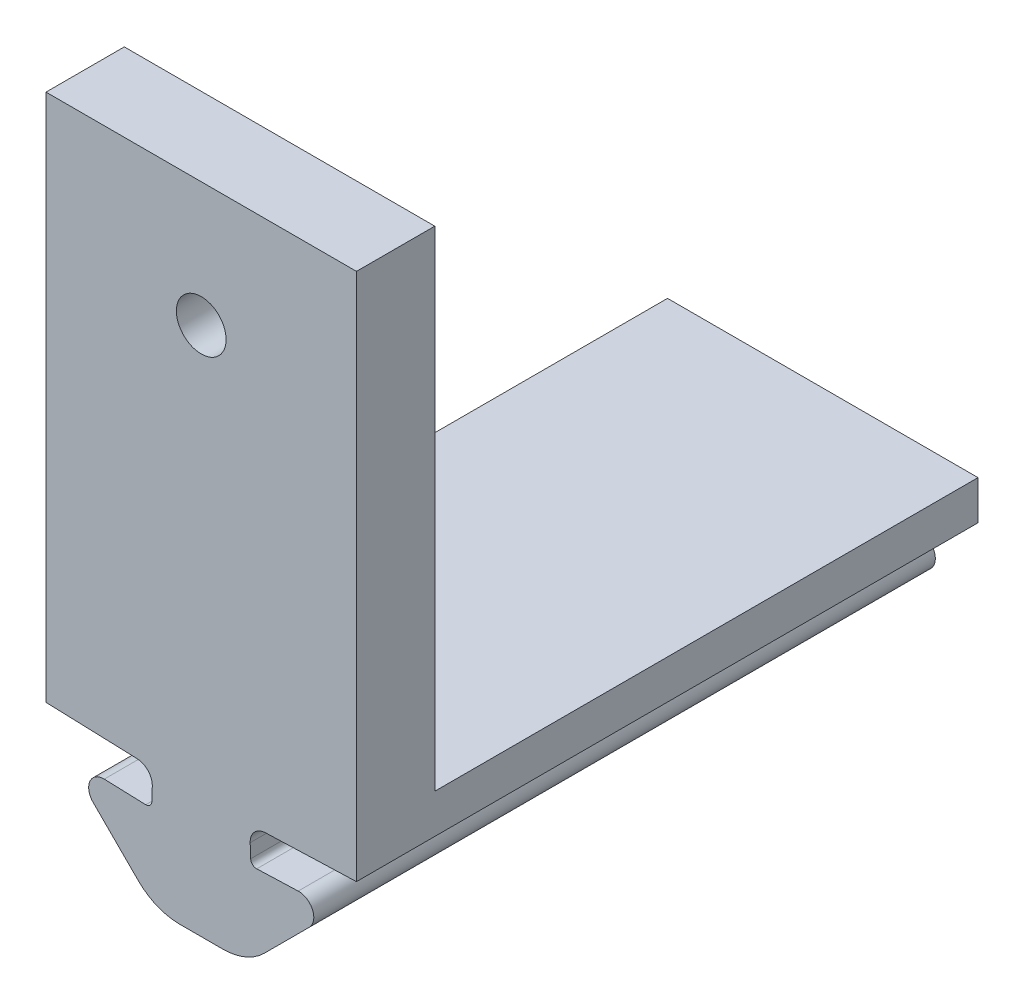
ISO-10303-21;
HEADER;
FILE_DESCRIPTION(('STEP AP214'),'2;1');
FILE_NAME('part.step','',(''),(''),'','','');
FILE_SCHEMA(('AUTOMOTIVE_DESIGN { 1 0 10303 214 1 1 1 1 }'));
ENDSEC;
DATA;
#1=APPLICATION_CONTEXT('core data for automotive mechanical design processes');
#2=APPLICATION_PROTOCOL_DEFINITION('international standard','automotive_design',2000,#1);
#3=PRODUCT_CONTEXT('',#1,'mechanical');
#4=PRODUCT('Part','Part','',(#3));
#5=PRODUCT_RELATED_PRODUCT_CATEGORY('part','',(#4));
#6=PRODUCT_DEFINITION_FORMATION('','',#4);
#7=PRODUCT_DEFINITION_CONTEXT('part definition',#1,'design');
#8=PRODUCT_DEFINITION('design','',#6,#7);
#9=PRODUCT_DEFINITION_SHAPE('','',#8);
#10=(LENGTH_UNIT() NAMED_UNIT(*) SI_UNIT(.MILLI.,.METRE.));
#11=(NAMED_UNIT(*) PLANE_ANGLE_UNIT() SI_UNIT($,.RADIAN.));
#12=(NAMED_UNIT(*) SI_UNIT($,.STERADIAN.) SOLID_ANGLE_UNIT());
#13=UNCERTAINTY_MEASURE_WITH_UNIT(LENGTH_MEASURE(1.E-05),#10,'distance_accuracy_value','');
#14=(GEOMETRIC_REPRESENTATION_CONTEXT(3) GLOBAL_UNCERTAINTY_ASSIGNED_CONTEXT((#13)) GLOBAL_UNIT_ASSIGNED_CONTEXT((#10,
#11,#12)) REPRESENTATION_CONTEXT('',''));
#15=CARTESIAN_POINT('',(0.,0.,0.));
#16=DIRECTION('',(0.,0.,1.));
#17=DIRECTION('',(1.,0.,0.));
#18=AXIS2_PLACEMENT_3D('',#15,#16,#17);
#19=CARTESIAN_POINT('',(-50.6754357820215,45.6203327442278,31.75));
#20=DIRECTION('',(0.,0.,-1.));
#21=DIRECTION('',(-1.,0.,0.));
#22=AXIS2_PLACEMENT_3D('',#19,#20,#21);
#23=CYLINDRICAL_SURFACE('',#22,0.300000000000002);
#24=CARTESIAN_POINT('',(-50.6754357820215,45.6203327442278,0.));
#25=DIRECTION('',(0.,0.,-1.));
#26=DIRECTION('',(1.,0.,0.));
#27=AXIS2_PLACEMENT_3D('',#24,#25,#26);
#28=CIRCLE('',#27,0.300000000000002);
#29=CARTESIAN_POINT('',(-50.3756185339158,45.609862895217,0.));
#30=VERTEX_POINT('',#29);
#31=CARTESIAN_POINT('',(-50.6859056310322,45.320515496122,0.));
#32=VERTEX_POINT('',#31);
#33=EDGE_CURVE('E167',#30,#32,#28,.T.);
#34=ORIENTED_EDGE('',*,*,#33,.T.);
#35=DIRECTION('',(0.,0.,-1.));
#36=VECTOR('',#35,1.);
#37=CARTESIAN_POINT('',(-50.6859056310322,45.320515496122,31.75));
#38=LINE('',#37,#36);
#39=CARTESIAN_POINT('',(-50.6859056310322,45.320515496122,31.75));
#40=VERTEX_POINT('',#39);
#41=EDGE_CURVE('E11',#40,#32,#38,.T.);
#42=ORIENTED_EDGE('',*,*,#41,.F.);
#43=CARTESIAN_POINT('',(-50.6754357820215,45.6203327442278,31.75));
#44=DIRECTION('',(0.,0.,-1.));
#45=DIRECTION('',(1.,0.,0.));
#46=AXIS2_PLACEMENT_3D('',#43,#44,#45);
#47=CIRCLE('',#46,0.300000000000002);
#48=CARTESIAN_POINT('',(-50.3756185339158,45.609862895217,31.75));
#49=VERTEX_POINT('',#48);
#50=EDGE_CURVE('E195',#49,#40,#47,.T.);
#51=ORIENTED_EDGE('',*,*,#50,.F.);
#52=DIRECTION('',(0.,0.,-1.));
#53=VECTOR('',#52,1.);
#54=CARTESIAN_POINT('',(-50.3756185339158,45.609862895217,31.75));
#55=LINE('',#54,#53);
#56=EDGE_CURVE('E163',#49,#30,#55,.T.);
#57=ORIENTED_EDGE('',*,*,#56,.T.);
#58=EDGE_LOOP('',(#34,#42,#51,#57));
#59=FACE_BOUND('',#58,.T.);
#60=ADVANCED_FACE('F47',(#59),#23,.F.);
#61=CARTESIAN_POINT('',(-50.6859056310322,45.320515496122,31.75));
#62=DIRECTION('',(-0.0348994967024436,-0.999390827019098,0.));
#63=DIRECTION('',(0.999390827019098,-0.0348994967024436,0.));
#64=AXIS2_PLACEMENT_3D('',#61,#62,#63);
#65=PLANE('',#64);
#66=DIRECTION('',(-0.999390827019098,0.0348994967024436,0.));
#67=VECTOR('',#66,1.);
#68=CARTESIAN_POINT('',(-50.6859056310322,45.320515496122,0.));
#69=LINE('',#68,#67);
#70=CARTESIAN_POINT('',(-52.803734095959,45.3944716957687,0.));
#71=VERTEX_POINT('',#70);
#72=EDGE_CURVE('E171',#32,#71,#69,.T.);
#73=ORIENTED_EDGE('',*,*,#72,.T.);
#74=DIRECTION('',(0.,0.,-1.));
#75=VECTOR('',#74,1.);
#76=CARTESIAN_POINT('',(-52.803734095959,45.3944716957687,31.75));
#77=LINE('',#76,#75);
#78=CARTESIAN_POINT('',(-52.803734095959,45.3944716957687,31.75));
#79=VERTEX_POINT('',#78);
#80=EDGE_CURVE('E55',#79,#71,#77,.T.);
#81=ORIENTED_EDGE('',*,*,#80,.F.);
#82=DIRECTION('',(-0.999390827019098,0.0348994967024436,0.));
#83=VECTOR('',#82,1.);
#84=CARTESIAN_POINT('',(-50.6859056310322,45.320515496122,31.75));
#85=LINE('',#84,#83);
#86=EDGE_CURVE('E115',#40,#79,#85,.T.);
#87=ORIENTED_EDGE('',*,*,#86,.F.);
#88=ORIENTED_EDGE('',*,*,#41,.T.);
#89=EDGE_LOOP('',(#73,#81,#87,#88));
#90=FACE_BOUND('',#89,.T.);
#91=ADVANCED_FACE('F511',(#90),#65,.F.);
#92=CARTESIAN_POINT('',(-52.8306099066512,44.6248491736012,31.75));
#93=DIRECTION('',(0.,0.,-1.));
#94=DIRECTION('',(-1.,0.,0.));
#95=AXIS2_PLACEMENT_3D('',#92,#93,#94);
#96=CYLINDRICAL_SURFACE('',#95,0.770091641188153);
#97=CARTESIAN_POINT('',(-52.8306099066512,44.6248491736012,0.));
#98=DIRECTION('',(0.,0.,1.));
#99=DIRECTION('',(1.,0.,0.));
#100=AXIS2_PLACEMENT_3D('',#97,#98,#99);
#101=CIRCLE('',#100,0.770091641188153);
#102=CARTESIAN_POINT('',(-53.3751469282704,44.0803121519819,0.));
#103=VERTEX_POINT('',#102);
#104=EDGE_CURVE('E175',#71,#103,#101,.T.);
#105=ORIENTED_EDGE('',*,*,#104,.T.);
#106=DIRECTION('',(0.,0.,-1.));
#107=VECTOR('',#106,1.);
#108=CARTESIAN_POINT('',(-53.3751469282704,44.0803121519819,31.75));
#109=LINE('',#108,#107);
#110=CARTESIAN_POINT('',(-53.3751469282704,44.0803121519819,31.75));
#111=VERTEX_POINT('',#110);
#112=EDGE_CURVE('E210',#111,#103,#109,.T.);
#113=ORIENTED_EDGE('',*,*,#112,.F.);
#114=CARTESIAN_POINT('',(-52.8306099066512,44.6248491736012,31.75));
#115=DIRECTION('',(0.,0.,1.));
#116=DIRECTION('',(1.,0.,0.));
#117=AXIS2_PLACEMENT_3D('',#114,#115,#116);
#118=CIRCLE('',#117,0.770091641188153);
#119=EDGE_CURVE('E220',#79,#111,#118,.T.);
#120=ORIENTED_EDGE('',*,*,#119,.F.);
#121=ORIENTED_EDGE('',*,*,#80,.T.);
#122=EDGE_LOOP('',(#105,#113,#120,#121));
#123=FACE_BOUND('',#122,.T.);
#124=ADVANCED_FACE('F218',(#123),#96,.T.);
#125=CARTESIAN_POINT('',(-51.0742666676735,41.7794318913851,31.75));
#126=DIRECTION('',(0.707106781186544,0.707106781186551,0.));
#127=DIRECTION('',(-0.707106781186551,0.707106781186544,0.));
#128=AXIS2_PLACEMENT_3D('',#125,#126,#127);
#129=PLANE('',#128);
#130=DIRECTION('',(0.707106781186551,-0.707106781186544,0.));
#131=VECTOR('',#130,1.);
#132=CARTESIAN_POINT('',(-51.0742666676735,41.7794318913851,0.));
#133=LINE('',#132,#131);
#134=CARTESIAN_POINT('',(-51.0742666676735,41.7794318913851,0.));
#135=VERTEX_POINT('',#134);
#136=EDGE_CURVE('E178',#103,#135,#133,.T.);
#137=ORIENTED_EDGE('',*,*,#136,.T.);
#138=DIRECTION('',(0.,0.,-1.));
#139=VECTOR('',#138,1.);
#140=CARTESIAN_POINT('',(-51.0742666676735,41.7794318913851,31.75));
#141=LINE('',#140,#139);
#142=CARTESIAN_POINT('',(-51.0742666676735,41.7794318913851,31.75));
#143=VERTEX_POINT('',#142);
#144=EDGE_CURVE('E206',#143,#135,#141,.T.);
#145=ORIENTED_EDGE('',*,*,#144,.F.);
#146=DIRECTION('',(0.707106781186551,-0.707106781186544,0.));
#147=VECTOR('',#146,1.);
#148=CARTESIAN_POINT('',(-51.0742666676735,41.7794318913851,31.75));
#149=LINE('',#148,#147);
#150=EDGE_CURVE('E239',#111,#143,#149,.T.);
#151=ORIENTED_EDGE('',*,*,#150,.F.);
#152=ORIENTED_EDGE('',*,*,#112,.T.);
#153=EDGE_LOOP('',(#137,#145,#151,#152));
#154=FACE_BOUND('',#153,.T.);
#155=ADVANCED_FACE('F229',(#154),#129,.F.);
#156=CARTESIAN_POINT('',(-48.9529463241139,43.9007522349447,31.75));
#157=DIRECTION('',(0.,0.,-1.));
#158=DIRECTION('',(-1.,0.,0.));
#159=AXIS2_PLACEMENT_3D('',#156,#157,#158);
#160=CYLINDRICAL_SURFACE('',#159,3.);
#161=CARTESIAN_POINT('',(-48.9529463241139,43.9007522349447,0.));
#162=DIRECTION('',(0.,0.,1.));
#163=DIRECTION('',(1.,0.,0.));
#164=AXIS2_PLACEMENT_3D('',#161,#162,#163);
#165=CIRCLE('',#164,3.);
#166=CARTESIAN_POINT('',(-48.9529463241139,40.9007522349447,0.));
#167=VERTEX_POINT('',#166);
#168=EDGE_CURVE('E181',#135,#167,#165,.T.);
#169=ORIENTED_EDGE('',*,*,#168,.T.);
#170=DIRECTION('',(0.,0.,-1.));
#171=VECTOR('',#170,1.);
#172=CARTESIAN_POINT('',(-48.9529463241139,40.9007522349447,31.75));
#173=LINE('',#172,#171);
#174=CARTESIAN_POINT('',(-48.9529463241139,40.9007522349447,31.75));
#175=VERTEX_POINT('',#174);
#176=EDGE_CURVE('E202',#175,#167,#173,.T.);
#177=ORIENTED_EDGE('',*,*,#176,.F.);
#178=CARTESIAN_POINT('',(-48.9529463241139,43.9007522349447,31.75));
#179=DIRECTION('',(0.,0.,1.));
#180=DIRECTION('',(1.,0.,0.));
#181=AXIS2_PLACEMENT_3D('',#178,#179,#180);
#182=CIRCLE('',#181,3.);
#183=EDGE_CURVE('E235',#143,#175,#182,.T.);
#184=ORIENTED_EDGE('',*,*,#183,.F.);
#185=ORIENTED_EDGE('',*,*,#144,.T.);
#186=EDGE_LOOP('',(#169,#177,#184,#185));
#187=FACE_BOUND('',#186,.T.);
#188=ADVANCED_FACE('F233',(#187),#160,.T.);
#189=CARTESIAN_POINT('',(-47.8507015478393,40.9007522349447,31.75));
#190=DIRECTION('',(0.,1.,0.));
#191=DIRECTION('',(0.,0.,1.));
#192=AXIS2_PLACEMENT_3D('',#189,#190,#191);
#193=PLANE('',#192);
#194=DIRECTION('',(1.,0.,0.));
#195=VECTOR('',#194,1.);
#196=CARTESIAN_POINT('',(-47.8507015478393,40.9007522349447,0.));
#197=LINE('',#196,#195);
#198=CARTESIAN_POINT('',(-46.7484567715648,40.9007522349447,0.));
#199=VERTEX_POINT('',#198);
#200=EDGE_CURVE('E184',#167,#199,#197,.T.);
#201=ORIENTED_EDGE('',*,*,#200,.T.);
#202=DIRECTION('',(0.,0.,-1.));
#203=VECTOR('',#202,1.);
#204=CARTESIAN_POINT('',(-46.7484567715648,40.9007522349447,31.75));
#205=LINE('',#204,#203);
#206=CARTESIAN_POINT('',(-46.7484567715648,40.9007522349447,31.75));
#207=VERTEX_POINT('',#206);
#208=EDGE_CURVE('E266',#207,#199,#205,.T.);
#209=ORIENTED_EDGE('',*,*,#208,.F.);
#210=DIRECTION('',(1.,0.,0.));
#211=VECTOR('',#210,1.);
#212=CARTESIAN_POINT('',(-47.8507015478393,40.9007522349447,31.75));
#213=LINE('',#212,#211);
#214=EDGE_CURVE('E146',#175,#207,#213,.T.);
#215=ORIENTED_EDGE('',*,*,#214,.F.);
#216=ORIENTED_EDGE('',*,*,#176,.T.);
#217=EDGE_LOOP('',(#201,#209,#215,#216));
#218=FACE_BOUND('',#217,.T.);
#219=ADVANCED_FACE('F532',(#218),#193,.F.);
#220=CARTESIAN_POINT('',(-55.7809025544344,47.2995338889829,31.75));
#221=DIRECTION('',(0.0348994967024436,0.999390827019098,0.));
#222=DIRECTION('',(-0.999390827019098,0.0348994967024436,0.));
#223=AXIS2_PLACEMENT_3D('',#220,#221,#222);
#224=PLANE('',#223);
#225=DIRECTION('',(0.999390827019098,-0.0348994967024436,0.));
#226=VECTOR('',#225,1.);
#227=CARTESIAN_POINT('',(-55.7809025544344,47.2995338889829,0.));
#228=LINE('',#227,#226);
#229=CARTESIAN_POINT('',(-55.7809025544344,47.2995338889829,0.));
#230=VERTEX_POINT('',#229);
#231=CARTESIAN_POINT('',(-51.1227819504774,47.1368687331076,0.));
#232=VERTEX_POINT('',#231);
#233=EDGE_CURVE('E152',#230,#232,#228,.T.);
#234=ORIENTED_EDGE('',*,*,#233,.T.);
#235=DIRECTION('',(0.,0.,-1.));
#236=VECTOR('',#235,1.);
#237=CARTESIAN_POINT('',(-51.1227819504774,47.1368687331076,31.75));
#238=LINE('',#237,#236);
#239=CARTESIAN_POINT('',(-51.1227819504774,47.1368687331076,31.75));
#240=VERTEX_POINT('',#239);
#241=EDGE_CURVE('E149',#240,#232,#238,.T.);
#242=ORIENTED_EDGE('',*,*,#241,.F.);
#243=DIRECTION('',(0.999390827019098,-0.0348994967024436,0.));
#244=VECTOR('',#243,1.);
#245=CARTESIAN_POINT('',(-55.7809025544344,47.2995338889829,31.75));
#246=LINE('',#245,#244);
#247=CARTESIAN_POINT('',(-55.7809025544344,47.2995338889829,31.75));
#248=VERTEX_POINT('',#247);
#249=EDGE_CURVE('E134',#248,#240,#246,.T.);
#250=ORIENTED_EDGE('',*,*,#249,.F.);
#251=DIRECTION('',(0.,0.,-1.));
#252=VECTOR('',#251,1.);
#253=CARTESIAN_POINT('',(-55.7809025544344,47.2995338889829,31.75));
#254=LINE('',#253,#252);
#255=EDGE_CURVE('E156',#248,#230,#254,.T.);
#256=ORIENTED_EDGE('',*,*,#255,.T.);
#257=EDGE_LOOP('',(#234,#242,#250,#256));
#258=FACE_BOUND('',#257,.T.);
#259=ADVANCED_FACE('F150',(#258),#224,.F.);
#260=CARTESIAN_POINT('',(-51.1507015478393,46.3373560714924,31.75));
#261=DIRECTION('',(0.,0.,-1.));
#262=DIRECTION('',(-1.,0.,0.));
#263=AXIS2_PLACEMENT_3D('',#260,#261,#262);
#264=CYLINDRICAL_SURFACE('',#263,0.799999999999997);
#265=CARTESIAN_POINT('',(-51.1507015478393,46.3373560714924,0.));
#266=DIRECTION('',(0.,0.,-1.));
#267=DIRECTION('',(1.,0.,0.));
#268=AXIS2_PLACEMENT_3D('',#265,#266,#267);
#269=CIRCLE('',#268,0.799999999999997);
#270=CARTESIAN_POINT('',(-50.3511888862241,46.3094364741304,0.));
#271=VERTEX_POINT('',#270);
#272=EDGE_CURVE('E190',#232,#271,#269,.T.);
#273=ORIENTED_EDGE('',*,*,#272,.T.);
#274=DIRECTION('',(0.,0.,-1.));
#275=VECTOR('',#274,1.);
#276=CARTESIAN_POINT('',(-50.3511888862241,46.3094364741304,31.75));
#277=LINE('',#276,#275);
#278=CARTESIAN_POINT('',(-50.3511888862241,46.3094364741304,31.75));
#279=VERTEX_POINT('',#278);
#280=EDGE_CURVE('E157',#279,#271,#277,.T.);
#281=ORIENTED_EDGE('',*,*,#280,.F.);
#282=CARTESIAN_POINT('',(-51.1507015478393,46.3373560714924,31.75));
#283=DIRECTION('',(0.,0.,-1.));
#284=DIRECTION('',(1.,0.,0.));
#285=AXIS2_PLACEMENT_3D('',#282,#283,#284);
#286=CIRCLE('',#285,0.799999999999997);
#287=EDGE_CURVE('E138',#240,#279,#286,.T.);
#288=ORIENTED_EDGE('',*,*,#287,.F.);
#289=ORIENTED_EDGE('',*,*,#241,.T.);
#290=EDGE_LOOP('',(#273,#281,#288,#289));
#291=FACE_BOUND('',#290,.T.);
#292=ADVANCED_FACE('F159',(#291),#264,.F.);
#293=CARTESIAN_POINT('',(-50.3756185339158,45.609862895217,31.75));
#294=DIRECTION('',(0.999390827019098,-0.034899496702436,0.));
#295=DIRECTION('',(0.034899496702436,0.999390827019098,0.));
#296=AXIS2_PLACEMENT_3D('',#293,#294,#295);
#297=PLANE('',#296);
#298=DIRECTION('',(-0.034899496702436,-0.999390827019098,0.));
#299=VECTOR('',#298,1.);
#300=CARTESIAN_POINT('',(-50.3756185339158,45.609862895217,0.));
#301=LINE('',#300,#299);
#302=EDGE_CURVE('E107',#271,#30,#301,.T.);
#303=ORIENTED_EDGE('',*,*,#302,.T.);
#304=ORIENTED_EDGE('',*,*,#56,.F.);
#305=DIRECTION('',(-0.034899496702436,-0.999390827019098,0.));
#306=VECTOR('',#305,1.);
#307=CARTESIAN_POINT('',(-50.3756185339158,45.609862895217,31.75));
#308=LINE('',#307,#306);
#309=EDGE_CURVE('E71',#279,#49,#308,.T.);
#310=ORIENTED_EDGE('',*,*,#309,.F.);
#311=ORIENTED_EDGE('',*,*,#280,.T.);
#312=EDGE_LOOP('',(#303,#304,#310,#311));
#313=FACE_BOUND('',#312,.T.);
#314=ADVANCED_FACE('F519',(#313),#297,.F.);
#315=CARTESIAN_POINT('',(-50.6754357820215,45.6203327442278,31.75));
#316=DIRECTION('',(0.,0.,1.));
#317=DIRECTION('',(1.,0.,0.));
#318=AXIS2_PLACEMENT_3D('',#315,#316,#317);
#319=PLANE('',#318);
#320=CARTESIAN_POINT('',(-47.8507015478393,67.9495338889829,31.75));
#321=DIRECTION('',(0.,0.,-1.));
#322=DIRECTION('',(-1.,0.,0.));
#323=AXIS2_PLACEMENT_3D('',#320,#321,#322);
#324=CIRCLE('',#323,1.27);
#325=CARTESIAN_POINT('',(-49.1207015478393,67.9495338889829,31.75));
#326=VERTEX_POINT('',#325);
#327=EDGE_CURVE('E386',#326,#326,#324,.T.);
#328=ORIENTED_EDGE('',*,*,#327,.T.);
#329=EDGE_LOOP('',(#328));
#330=FACE_BOUND('',#329,.T.);
#331=ORIENTED_EDGE('',*,*,#50,.T.);
#332=ORIENTED_EDGE('',*,*,#86,.T.);
#333=ORIENTED_EDGE('',*,*,#119,.T.);
#334=ORIENTED_EDGE('',*,*,#150,.T.);
#335=ORIENTED_EDGE('',*,*,#183,.T.);
#336=ORIENTED_EDGE('',*,*,#214,.T.);
#337=CARTESIAN_POINT('',(-46.7484567715648,43.9007522349447,31.75));
#338=DIRECTION('',(0.,0.,-1.));
#339=DIRECTION('',(-1.,0.,0.));
#340=AXIS2_PLACEMENT_3D('',#337,#338,#339);
#341=CIRCLE('',#340,3.);
#342=CARTESIAN_POINT('',(-44.6271364280052,41.7794318913851,31.75));
#343=VERTEX_POINT('',#342);
#344=EDGE_CURVE('E331',#343,#207,#341,.T.);
#345=ORIENTED_EDGE('',*,*,#344,.F.);
#346=DIRECTION('',(-0.707106781186551,-0.707106781186544,0.));
#347=VECTOR('',#346,1.);
#348=CARTESIAN_POINT('',(-44.6271364280052,41.7794318913851,31.75));
#349=LINE('',#348,#347);
#350=CARTESIAN_POINT('',(-42.3262561674083,44.0803121519819,31.75));
#351=VERTEX_POINT('',#350);
#352=EDGE_CURVE('E327',#351,#343,#349,.T.);
#353=ORIENTED_EDGE('',*,*,#352,.F.);
#354=CARTESIAN_POINT('',(-42.8707931890275,44.6248491736012,31.75));
#355=DIRECTION('',(0.,0.,-1.));
#356=DIRECTION('',(-1.,0.,0.));
#357=AXIS2_PLACEMENT_3D('',#354,#355,#356);
#358=CIRCLE('',#357,0.770091641188153);
#359=CARTESIAN_POINT('',(-42.8976689997197,45.3944716957687,31.75));
#360=VERTEX_POINT('',#359);
#361=EDGE_CURVE('E323',#360,#351,#358,.T.);
#362=ORIENTED_EDGE('',*,*,#361,.F.);
#363=DIRECTION('',(0.999390827019098,0.0348994967024436,0.));
#364=VECTOR('',#363,1.);
#365=CARTESIAN_POINT('',(-45.0154974646464,45.320515496122,31.75));
#366=LINE('',#365,#364);
#367=CARTESIAN_POINT('',(-45.0154974646464,45.320515496122,31.75));
#368=VERTEX_POINT('',#367);
#369=EDGE_CURVE('E286',#368,#360,#366,.T.);
#370=ORIENTED_EDGE('',*,*,#369,.F.);
#371=CARTESIAN_POINT('',(-45.0259673136572,45.6203327442278,31.75));
#372=DIRECTION('',(0.,0.,1.));
#373=DIRECTION('',(-1.,0.,0.));
#374=AXIS2_PLACEMENT_3D('',#371,#372,#373);
#375=CIRCLE('',#374,0.300000000000002);
#376=CARTESIAN_POINT('',(-45.3257845617629,45.609862895217,31.75));
#377=VERTEX_POINT('',#376);
#378=EDGE_CURVE('E291',#377,#368,#375,.T.);
#379=ORIENTED_EDGE('',*,*,#378,.F.);
#380=DIRECTION('',(0.034899496702436,-0.999390827019098,0.));
#381=VECTOR('',#380,1.);
#382=CARTESIAN_POINT('',(-45.3257845617629,45.609862895217,31.75));
#383=LINE('',#382,#381);
#384=CARTESIAN_POINT('',(-45.3502142094546,46.3094364741304,31.75));
#385=VERTEX_POINT('',#384);
#386=EDGE_CURVE('E343',#385,#377,#383,.T.);
#387=ORIENTED_EDGE('',*,*,#386,.F.);
#388=CARTESIAN_POINT('',(-44.5507015478393,46.3373560714924,31.75));
#389=DIRECTION('',(0.,0.,1.));
#390=DIRECTION('',(-1.,0.,0.));
#391=AXIS2_PLACEMENT_3D('',#388,#389,#390);
#392=CIRCLE('',#391,0.799999999999997);
#393=CARTESIAN_POINT('',(-44.5786211452013,47.1368687331076,31.75));
#394=VERTEX_POINT('',#393);
#395=EDGE_CURVE('E339',#394,#385,#392,.T.);
#396=ORIENTED_EDGE('',*,*,#395,.F.);
#397=DIRECTION('',(-0.999390827019098,-0.0348994967024436,0.));
#398=VECTOR('',#397,1.);
#399=CARTESIAN_POINT('',(-39.9205005412442,47.2995338889829,31.75));
#400=LINE('',#399,#398);
#401=CARTESIAN_POINT('',(-39.9205005412442,47.2995338889829,31.75));
#402=VERTEX_POINT('',#401);
#403=EDGE_CURVE('E335',#402,#394,#400,.T.);
#404=ORIENTED_EDGE('',*,*,#403,.F.);
#405=DIRECTION('',(0.,-1.,0.));
#406=VECTOR('',#405,1.);
#407=CARTESIAN_POINT('',(-39.9205005412442,49.2995338889829,31.75));
#408=LINE('',#407,#406);
#409=CARTESIAN_POINT('',(-39.9205005412442,74.2995338889829,31.75));
#410=VERTEX_POINT('',#409);
#411=EDGE_CURVE('E352',#410,#402,#408,.T.);
#412=ORIENTED_EDGE('',*,*,#411,.F.);
#413=DIRECTION('',(1.,0.,0.));
#414=VECTOR('',#413,1.);
#415=CARTESIAN_POINT('',(-55.7809025544344,74.2995338889829,31.75));
#416=LINE('',#415,#414);
#417=CARTESIAN_POINT('',(-55.7809025544344,74.2995338889829,31.75));
#418=VERTEX_POINT('',#417);
#419=EDGE_CURVE('E394',#418,#410,#416,.T.);
#420=ORIENTED_EDGE('',*,*,#419,.F.);
#421=DIRECTION('',(0.,-1.,0.));
#422=VECTOR('',#421,1.);
#423=CARTESIAN_POINT('',(-55.7809025544344,49.2995338889829,31.75));
#424=LINE('',#423,#422);
#425=EDGE_CURVE('E142',#418,#248,#424,.T.);
#426=ORIENTED_EDGE('',*,*,#425,.T.);
#427=ORIENTED_EDGE('',*,*,#249,.T.);
#428=ORIENTED_EDGE('',*,*,#287,.T.);
#429=ORIENTED_EDGE('',*,*,#309,.T.);
#430=EDGE_LOOP('',(#331,#332,#333,#334,#335,#336,#345,#353,#362,#370,#379,#387,#396,#404,#412,
#420,#426,#427,#428,#429));
#431=FACE_BOUND('',#430,.T.);
#432=ADVANCED_FACE('F136',(#330,#431),#319,.T.);
#433=CARTESIAN_POINT('',(-50.6754357820215,45.6203327442278,0.));
#434=DIRECTION('',(0.,0.,1.));
#435=DIRECTION('',(1.,0.,0.));
#436=AXIS2_PLACEMENT_3D('',#433,#434,#435);
#437=PLANE('',#436);
#438=ORIENTED_EDGE('',*,*,#33,.F.);
#439=ORIENTED_EDGE('',*,*,#302,.F.);
#440=ORIENTED_EDGE('',*,*,#272,.F.);
#441=ORIENTED_EDGE('',*,*,#233,.F.);
#442=DIRECTION('',(0.,-1.,0.));
#443=VECTOR('',#442,1.);
#444=CARTESIAN_POINT('',(-55.7809025544344,49.2995338889829,0.));
#445=LINE('',#444,#443);
#446=CARTESIAN_POINT('',(-55.7809025544344,49.2995338889829,0.));
#447=VERTEX_POINT('',#446);
#448=EDGE_CURVE('E360',#447,#230,#445,.T.);
#449=ORIENTED_EDGE('',*,*,#448,.F.);
#450=DIRECTION('',(-1.,0.,0.));
#451=VECTOR('',#450,1.);
#452=CARTESIAN_POINT('',(-55.7809025544344,49.2995338889829,0.));
#453=LINE('',#452,#451);
#454=CARTESIAN_POINT('',(-39.9205005412442,49.2995338889829,0.));
#455=VERTEX_POINT('',#454);
#456=EDGE_CURVE('E364',#455,#447,#453,.T.);
#457=ORIENTED_EDGE('',*,*,#456,.F.);
#458=DIRECTION('',(0.,-1.,0.));
#459=VECTOR('',#458,1.);
#460=CARTESIAN_POINT('',(-39.9205005412442,49.2995338889829,0.));
#461=LINE('',#460,#459);
#462=CARTESIAN_POINT('',(-39.9205005412442,47.2995338889829,0.));
#463=VERTEX_POINT('',#462);
#464=EDGE_CURVE('E356',#455,#463,#461,.T.);
#465=ORIENTED_EDGE('',*,*,#464,.T.);
#466=DIRECTION('',(-0.999390827019098,-0.0348994967024436,0.));
#467=VECTOR('',#466,1.);
#468=CARTESIAN_POINT('',(-39.9205005412442,47.2995338889829,0.));
#469=LINE('',#468,#467);
#470=CARTESIAN_POINT('',(-44.5786211452013,47.1368687331076,0.));
#471=VERTEX_POINT('',#470);
#472=EDGE_CURVE('E304',#463,#471,#469,.T.);
#473=ORIENTED_EDGE('',*,*,#472,.T.);
#474=CARTESIAN_POINT('',(-44.5507015478393,46.3373560714924,0.));
#475=DIRECTION('',(0.,0.,1.));
#476=DIRECTION('',(-1.,0.,0.));
#477=AXIS2_PLACEMENT_3D('',#474,#475,#476);
#478=CIRCLE('',#477,0.799999999999997);
#479=CARTESIAN_POINT('',(-45.3502142094546,46.3094364741304,0.));
#480=VERTEX_POINT('',#479);
#481=EDGE_CURVE('E308',#471,#480,#478,.T.);
#482=ORIENTED_EDGE('',*,*,#481,.T.);
#483=DIRECTION('',(0.034899496702436,-0.999390827019098,0.));
#484=VECTOR('',#483,1.);
#485=CARTESIAN_POINT('',(-45.3257845617629,45.609862895217,0.));
#486=LINE('',#485,#484);
#487=CARTESIAN_POINT('',(-45.3257845617629,45.609862895217,0.));
#488=VERTEX_POINT('',#487);
#489=EDGE_CURVE('E312',#480,#488,#486,.T.);
#490=ORIENTED_EDGE('',*,*,#489,.T.);
#491=CARTESIAN_POINT('',(-45.0259673136572,45.6203327442278,0.));
#492=DIRECTION('',(0.,0.,1.));
#493=DIRECTION('',(-1.,0.,0.));
#494=AXIS2_PLACEMENT_3D('',#491,#492,#493);
#495=CIRCLE('',#494,0.300000000000002);
#496=CARTESIAN_POINT('',(-45.0154974646464,45.320515496122,0.));
#497=VERTEX_POINT('',#496);
#498=EDGE_CURVE('E316',#488,#497,#495,.T.);
#499=ORIENTED_EDGE('',*,*,#498,.T.);
#500=DIRECTION('',(0.999390827019098,0.0348994967024436,0.));
#501=VECTOR('',#500,1.);
#502=CARTESIAN_POINT('',(-45.0154974646464,45.320515496122,0.));
#503=LINE('',#502,#501);
#504=CARTESIAN_POINT('',(-42.8976689997197,45.3944716957687,0.));
#505=VERTEX_POINT('',#504);
#506=EDGE_CURVE('E287',#497,#505,#503,.T.);
#507=ORIENTED_EDGE('',*,*,#506,.T.);
#508=CARTESIAN_POINT('',(-42.8707931890275,44.6248491736012,0.));
#509=DIRECTION('',(0.,0.,-1.));
#510=DIRECTION('',(-1.,0.,0.));
#511=AXIS2_PLACEMENT_3D('',#508,#509,#510);
#512=CIRCLE('',#511,0.770091641188153);
#513=CARTESIAN_POINT('',(-42.3262561674083,44.0803121519819,0.));
#514=VERTEX_POINT('',#513);
#515=EDGE_CURVE('E292',#505,#514,#512,.T.);
#516=ORIENTED_EDGE('',*,*,#515,.T.);
#517=DIRECTION('',(-0.707106781186551,-0.707106781186544,0.));
#518=VECTOR('',#517,1.);
#519=CARTESIAN_POINT('',(-44.6271364280052,41.7794318913851,0.));
#520=LINE('',#519,#518);
#521=CARTESIAN_POINT('',(-44.6271364280052,41.7794318913851,0.));
#522=VERTEX_POINT('',#521);
#523=EDGE_CURVE('E296',#514,#522,#520,.T.);
#524=ORIENTED_EDGE('',*,*,#523,.T.);
#525=CARTESIAN_POINT('',(-46.7484567715648,43.9007522349447,0.));
#526=DIRECTION('',(0.,0.,-1.));
#527=DIRECTION('',(-1.,0.,0.));
#528=AXIS2_PLACEMENT_3D('',#525,#526,#527);
#529=CIRCLE('',#528,3.);
#530=EDGE_CURVE('E300',#522,#199,#529,.T.);
#531=ORIENTED_EDGE('',*,*,#530,.T.);
#532=ORIENTED_EDGE('',*,*,#200,.F.);
#533=ORIENTED_EDGE('',*,*,#168,.F.);
#534=ORIENTED_EDGE('',*,*,#136,.F.);
#535=ORIENTED_EDGE('',*,*,#104,.F.);
#536=ORIENTED_EDGE('',*,*,#72,.F.);
#537=EDGE_LOOP('',(#438,#439,#440,#441,#449,#457,#465,#473,#482,#490,#499,#507,#516,#524,#531,
#532,#533,#534,#535,#536));
#538=FACE_BOUND('',#537,.T.);
#539=ADVANCED_FACE('F224',(#538),#437,.F.);
#540=CARTESIAN_POINT('',(-45.0259673136572,45.6203327442278,31.75));
#541=DIRECTION('',(0.,0.,-1.));
#542=DIRECTION('',(-1.,0.,0.));
#543=AXIS2_PLACEMENT_3D('',#540,#541,#542);
#544=CYLINDRICAL_SURFACE('',#543,0.300000000000002);
#545=ORIENTED_EDGE('',*,*,#498,.F.);
#546=DIRECTION('',(0.,0.,-1.));
#547=VECTOR('',#546,1.);
#548=CARTESIAN_POINT('',(-45.3257845617629,45.609862895217,31.75));
#549=LINE('',#548,#547);
#550=EDGE_CURVE('E172',#377,#488,#549,.T.);
#551=ORIENTED_EDGE('',*,*,#550,.F.);
#552=ORIENTED_EDGE('',*,*,#378,.T.);
#553=DIRECTION('',(0.,0.,-1.));
#554=VECTOR('',#553,1.);
#555=CARTESIAN_POINT('',(-45.0154974646464,45.320515496122,31.75));
#556=LINE('',#555,#554);
#557=EDGE_CURVE('E282',#368,#497,#556,.T.);
#558=ORIENTED_EDGE('',*,*,#557,.T.);
#559=EDGE_LOOP('',(#545,#551,#552,#558));
#560=FACE_BOUND('',#559,.T.);
#561=ADVANCED_FACE('F492',(#560),#544,.F.);
#562=CARTESIAN_POINT('',(-45.3257845617629,45.609862895217,31.75));
#563=DIRECTION('',(0.999390827019098,0.034899496702436,0.));
#564=DIRECTION('',(-0.034899496702436,0.999390827019098,0.));
#565=AXIS2_PLACEMENT_3D('',#562,#563,#564);
#566=PLANE('',#565);
#567=ORIENTED_EDGE('',*,*,#489,.F.);
#568=DIRECTION('',(0.,0.,-1.));
#569=VECTOR('',#568,1.);
#570=CARTESIAN_POINT('',(-45.3502142094546,46.3094364741304,31.75));
#571=LINE('',#570,#569);
#572=EDGE_CURVE('E254',#385,#480,#571,.T.);
#573=ORIENTED_EDGE('',*,*,#572,.F.);
#574=ORIENTED_EDGE('',*,*,#386,.T.);
#575=ORIENTED_EDGE('',*,*,#550,.T.);
#576=EDGE_LOOP('',(#567,#573,#574,#575));
#577=FACE_BOUND('',#576,.T.);
#578=ADVANCED_FACE('F603',(#577),#566,.T.);
#579=CARTESIAN_POINT('',(-44.5507015478393,46.3373560714924,31.75));
#580=DIRECTION('',(0.,0.,-1.));
#581=DIRECTION('',(-1.,0.,0.));
#582=AXIS2_PLACEMENT_3D('',#579,#580,#581);
#583=CYLINDRICAL_SURFACE('',#582,0.799999999999997);
#584=ORIENTED_EDGE('',*,*,#481,.F.);
#585=DIRECTION('',(0.,0.,-1.));
#586=VECTOR('',#585,1.);
#587=CARTESIAN_POINT('',(-44.5786211452013,47.1368687331076,31.75));
#588=LINE('',#587,#586);
#589=EDGE_CURVE('E258',#394,#471,#588,.T.);
#590=ORIENTED_EDGE('',*,*,#589,.F.);
#591=ORIENTED_EDGE('',*,*,#395,.T.);
#592=ORIENTED_EDGE('',*,*,#572,.T.);
#593=EDGE_LOOP('',(#584,#590,#591,#592));
#594=FACE_BOUND('',#593,.T.);
#595=ADVANCED_FACE('F610',(#594),#583,.F.);
#596=CARTESIAN_POINT('',(-39.9205005412442,47.2995338889829,31.75));
#597=DIRECTION('',(0.0348994967024436,-0.999390827019098,0.));
#598=DIRECTION('',(0.999390827019098,0.0348994967024436,0.));
#599=AXIS2_PLACEMENT_3D('',#596,#597,#598);
#600=PLANE('',#599);
#601=ORIENTED_EDGE('',*,*,#472,.F.);
#602=DIRECTION('',(0.,0.,-1.));
#603=VECTOR('',#602,1.);
#604=CARTESIAN_POINT('',(-39.9205005412442,47.2995338889829,31.75));
#605=LINE('',#604,#603);
#606=EDGE_CURVE('E262',#402,#463,#605,.T.);
#607=ORIENTED_EDGE('',*,*,#606,.F.);
#608=ORIENTED_EDGE('',*,*,#403,.T.);
#609=ORIENTED_EDGE('',*,*,#589,.T.);
#610=EDGE_LOOP('',(#601,#607,#608,#609));
#611=FACE_BOUND('',#610,.T.);
#612=ADVANCED_FACE('F619',(#611),#600,.T.);
#613=CARTESIAN_POINT('',(-46.7484567715648,43.9007522349447,31.75));
#614=DIRECTION('',(0.,0.,-1.));
#615=DIRECTION('',(-1.,0.,0.));
#616=AXIS2_PLACEMENT_3D('',#613,#614,#615);
#617=CYLINDRICAL_SURFACE('',#616,3.);
#618=ORIENTED_EDGE('',*,*,#530,.F.);
#619=DIRECTION('',(0.,0.,-1.));
#620=VECTOR('',#619,1.);
#621=CARTESIAN_POINT('',(-44.6271364280052,41.7794318913851,31.75));
#622=LINE('',#621,#620);
#623=EDGE_CURVE('E270',#343,#522,#622,.T.);
#624=ORIENTED_EDGE('',*,*,#623,.F.);
#625=ORIENTED_EDGE('',*,*,#344,.T.);
#626=ORIENTED_EDGE('',*,*,#208,.T.);
#627=EDGE_LOOP('',(#618,#624,#625,#626));
#628=FACE_BOUND('',#627,.T.);
#629=ADVANCED_FACE('F626',(#628),#617,.T.);
#630=CARTESIAN_POINT('',(-44.6271364280052,41.7794318913851,31.75));
#631=DIRECTION('',(0.707106781186544,-0.707106781186551,0.));
#632=DIRECTION('',(0.707106781186551,0.707106781186544,0.));
#633=AXIS2_PLACEMENT_3D('',#630,#631,#632);
#634=PLANE('',#633);
#635=ORIENTED_EDGE('',*,*,#523,.F.);
#636=DIRECTION('',(0.,0.,-1.));
#637=VECTOR('',#636,1.);
#638=CARTESIAN_POINT('',(-42.3262561674083,44.0803121519819,31.75));
#639=LINE('',#638,#637);
#640=EDGE_CURVE('E274',#351,#514,#639,.T.);
#641=ORIENTED_EDGE('',*,*,#640,.F.);
#642=ORIENTED_EDGE('',*,*,#352,.T.);
#643=ORIENTED_EDGE('',*,*,#623,.T.);
#644=EDGE_LOOP('',(#635,#641,#642,#643));
#645=FACE_BOUND('',#644,.T.);
#646=ADVANCED_FACE('F507',(#645),#634,.T.);
#647=CARTESIAN_POINT('',(-42.8707931890275,44.6248491736012,31.75));
#648=DIRECTION('',(0.,0.,-1.));
#649=DIRECTION('',(-1.,0.,0.));
#650=AXIS2_PLACEMENT_3D('',#647,#648,#649);
#651=CYLINDRICAL_SURFACE('',#650,0.770091641188153);
#652=ORIENTED_EDGE('',*,*,#515,.F.);
#653=DIRECTION('',(0.,0.,-1.));
#654=VECTOR('',#653,1.);
#655=CARTESIAN_POINT('',(-42.8976689997197,45.3944716957687,31.75));
#656=LINE('',#655,#654);
#657=EDGE_CURVE('E278',#360,#505,#656,.T.);
#658=ORIENTED_EDGE('',*,*,#657,.F.);
#659=ORIENTED_EDGE('',*,*,#361,.T.);
#660=ORIENTED_EDGE('',*,*,#640,.T.);
#661=EDGE_LOOP('',(#652,#658,#659,#660));
#662=FACE_BOUND('',#661,.T.);
#663=ADVANCED_FACE('F498',(#662),#651,.T.);
#664=CARTESIAN_POINT('',(-45.0154974646464,45.320515496122,31.75));
#665=DIRECTION('',(-0.0348994967024436,0.999390827019098,0.));
#666=DIRECTION('',(-0.999390827019098,-0.0348994967024436,0.));
#667=AXIS2_PLACEMENT_3D('',#664,#665,#666);
#668=PLANE('',#667);
#669=ORIENTED_EDGE('',*,*,#506,.F.);
#670=ORIENTED_EDGE('',*,*,#557,.F.);
#671=ORIENTED_EDGE('',*,*,#369,.T.);
#672=ORIENTED_EDGE('',*,*,#657,.T.);
#673=EDGE_LOOP('',(#669,#670,#671,#672));
#674=FACE_BOUND('',#673,.T.);
#675=ADVANCED_FACE('F496',(#674),#668,.T.);
#676=CARTESIAN_POINT('',(-55.7809025544344,49.2995338889829,0.));
#677=DIRECTION('',(1.,0.,0.));
#678=DIRECTION('',(0.,0.,-1.));
#679=AXIS2_PLACEMENT_3D('',#676,#677,#678);
#680=PLANE('',#679);
#681=ORIENTED_EDGE('',*,*,#255,.F.);
#682=ORIENTED_EDGE('',*,*,#425,.F.);
#683=DIRECTION('',(0.,0.,1.));
#684=VECTOR('',#683,1.);
#685=CARTESIAN_POINT('',(-55.7809025544344,74.2995338889829,27.75));
#686=LINE('',#685,#684);
#687=CARTESIAN_POINT('',(-55.7809025544344,74.2995338889829,27.75));
#688=VERTEX_POINT('',#687);
#689=EDGE_CURVE('E385',#688,#418,#686,.T.);
#690=ORIENTED_EDGE('',*,*,#689,.F.);
#691=DIRECTION('',(0.,-1.,0.));
#692=VECTOR('',#691,1.);
#693=CARTESIAN_POINT('',(-55.7809025544344,74.2995338889829,27.75));
#694=LINE('',#693,#692);
#695=CARTESIAN_POINT('',(-55.7809025544344,49.2995338889829,27.75));
#696=VERTEX_POINT('',#695);
#697=EDGE_CURVE('E378',#688,#696,#694,.T.);
#698=ORIENTED_EDGE('',*,*,#697,.T.);
#699=DIRECTION('',(0.,0.,1.));
#700=VECTOR('',#699,1.);
#701=CARTESIAN_POINT('',(-55.7809025544344,49.2995338889829,0.));
#702=LINE('',#701,#700);
#703=EDGE_CURVE('E371',#447,#696,#702,.T.);
#704=ORIENTED_EDGE('',*,*,#703,.F.);
#705=ORIENTED_EDGE('',*,*,#448,.T.);
#706=EDGE_LOOP('',(#681,#682,#690,#698,#704,#705));
#707=FACE_BOUND('',#706,.T.);
#708=ADVANCED_FACE('F432',(#707),#680,.F.);
#709=CARTESIAN_POINT('',(-39.9205005412442,49.2995338889829,0.));
#710=DIRECTION('',(-1.,0.,0.));
#711=DIRECTION('',(0.,0.,1.));
#712=AXIS2_PLACEMENT_3D('',#709,#710,#711);
#713=PLANE('',#712);
#714=ORIENTED_EDGE('',*,*,#606,.T.);
#715=ORIENTED_EDGE('',*,*,#464,.F.);
#716=DIRECTION('',(0.,0.,-1.));
#717=VECTOR('',#716,1.);
#718=CARTESIAN_POINT('',(-39.9205005412442,49.2995338889829,0.));
#719=LINE('',#718,#717);
#720=CARTESIAN_POINT('',(-39.9205005412442,49.2995338889829,27.75));
#721=VERTEX_POINT('',#720);
#722=EDGE_CURVE('E368',#721,#455,#719,.T.);
#723=ORIENTED_EDGE('',*,*,#722,.F.);
#724=DIRECTION('',(0.,-1.,0.));
#725=VECTOR('',#724,1.);
#726=CARTESIAN_POINT('',(-39.9205005412442,74.2995338889829,27.75));
#727=LINE('',#726,#725);
#728=CARTESIAN_POINT('',(-39.9205005412442,74.2995338889829,27.75));
#729=VERTEX_POINT('',#728);
#730=EDGE_CURVE('E374',#729,#721,#727,.T.);
#731=ORIENTED_EDGE('',*,*,#730,.F.);
#732=DIRECTION('',(0.,0.,-1.));
#733=VECTOR('',#732,1.);
#734=CARTESIAN_POINT('',(-39.9205005412442,74.2995338889829,27.75));
#735=LINE('',#734,#733);
#736=EDGE_CURVE('E390',#410,#729,#735,.T.);
#737=ORIENTED_EDGE('',*,*,#736,.F.);
#738=ORIENTED_EDGE('',*,*,#411,.T.);
#739=EDGE_LOOP('',(#714,#715,#723,#731,#737,#738));
#740=FACE_BOUND('',#739,.T.);
#741=ADVANCED_FACE('F505',(#740),#713,.F.);
#742=CARTESIAN_POINT('',(0.,49.2995338889829,0.));
#743=DIRECTION('',(0.,1.,0.));
#744=DIRECTION('',(0.,0.,1.));
#745=AXIS2_PLACEMENT_3D('',#742,#743,#744);
#746=PLANE('',#745);
#747=DIRECTION('',(-1.,0.,0.));
#748=VECTOR('',#747,1.);
#749=CARTESIAN_POINT('',(-55.7809025544344,49.2995338889829,27.75));
#750=LINE('',#749,#748);
#751=EDGE_CURVE('E62',#721,#696,#750,.T.);
#752=ORIENTED_EDGE('',*,*,#751,.F.);
#753=ORIENTED_EDGE('',*,*,#722,.T.);
#754=ORIENTED_EDGE('',*,*,#456,.T.);
#755=ORIENTED_EDGE('',*,*,#703,.T.);
#756=EDGE_LOOP('',(#752,#753,#754,#755));
#757=FACE_BOUND('',#756,.T.);
#758=ADVANCED_FACE('F420',(#757),#746,.T.);
#759=CARTESIAN_POINT('',(-55.7809025544344,74.2995338889829,27.75));
#760=DIRECTION('',(0.,0.,1.));
#761=DIRECTION('',(1.,0.,0.));
#762=AXIS2_PLACEMENT_3D('',#759,#760,#761);
#763=PLANE('',#762);
#764=CARTESIAN_POINT('',(-47.8507015478393,67.9495338889829,27.75));
#765=DIRECTION('',(0.,0.,-1.));
#766=DIRECTION('',(-1.,0.,0.));
#767=AXIS2_PLACEMENT_3D('',#764,#765,#766);
#768=CIRCLE('',#767,1.27);
#769=CARTESIAN_POINT('',(-49.1207015478393,67.9495338889829,27.75));
#770=VERTEX_POINT('',#769);
#771=EDGE_CURVE('E401',#770,#770,#768,.T.);
#772=ORIENTED_EDGE('',*,*,#771,.F.);
#773=EDGE_LOOP('',(#772));
#774=FACE_BOUND('',#773,.T.);
#775=ORIENTED_EDGE('',*,*,#751,.T.);
#776=ORIENTED_EDGE('',*,*,#697,.F.);
#777=DIRECTION('',(-1.,0.,0.));
#778=VECTOR('',#777,1.);
#779=CARTESIAN_POINT('',(-55.7809025544344,74.2995338889829,27.75));
#780=LINE('',#779,#778);
#781=EDGE_CURVE('E382',#729,#688,#780,.T.);
#782=ORIENTED_EDGE('',*,*,#781,.F.);
#783=ORIENTED_EDGE('',*,*,#730,.T.);
#784=EDGE_LOOP('',(#775,#776,#782,#783));
#785=FACE_BOUND('',#784,.T.);
#786=ADVANCED_FACE('F417',(#774,#785),#763,.F.);
#787=CARTESIAN_POINT('',(0.,74.2995338889829,0.));
#788=DIRECTION('',(0.,1.,0.));
#789=DIRECTION('',(0.,0.,1.));
#790=AXIS2_PLACEMENT_3D('',#787,#788,#789);
#791=PLANE('',#790);
#792=ORIENTED_EDGE('',*,*,#689,.T.);
#793=ORIENTED_EDGE('',*,*,#419,.T.);
#794=ORIENTED_EDGE('',*,*,#736,.T.);
#795=ORIENTED_EDGE('',*,*,#781,.T.);
#796=EDGE_LOOP('',(#792,#793,#794,#795));
#797=FACE_BOUND('',#796,.T.);
#798=ADVANCED_FACE('F413',(#797),#791,.T.);
#799=CARTESIAN_POINT('',(-47.8507015478393,67.9495338889829,31.75));
#800=DIRECTION('',(0.,0.,-1.));
#801=DIRECTION('',(-1.,0.,0.));
#802=AXIS2_PLACEMENT_3D('',#799,#800,#801);
#803=CYLINDRICAL_SURFACE('',#802,1.27);
#804=ORIENTED_EDGE('',*,*,#327,.F.);
#805=EDGE_LOOP('',(#804));
#806=FACE_BOUND('',#805,.T.);
#807=ORIENTED_EDGE('',*,*,#771,.T.);
#808=EDGE_LOOP('',(#807));
#809=FACE_BOUND('',#808,.T.);
#810=ADVANCED_FACE('F410',(#806,#809),#803,.F.);
#811=CLOSED_SHELL('',(#60,#91,#124,#155,#188,#219,#259,#292,#314,#432,#539,#561,#578,#595,#612,
#629,#646,#663,#675,#708,#741,#758,#786,#798,#810));
#812=MANIFOLD_SOLID_BREP('B2',#811);
#813=ADVANCED_BREP_SHAPE_REPRESENTATION('',(#18,#812),#14);
#814=SHAPE_DEFINITION_REPRESENTATION(#9,#813);
ENDSEC;
END-ISO-10303-21;
